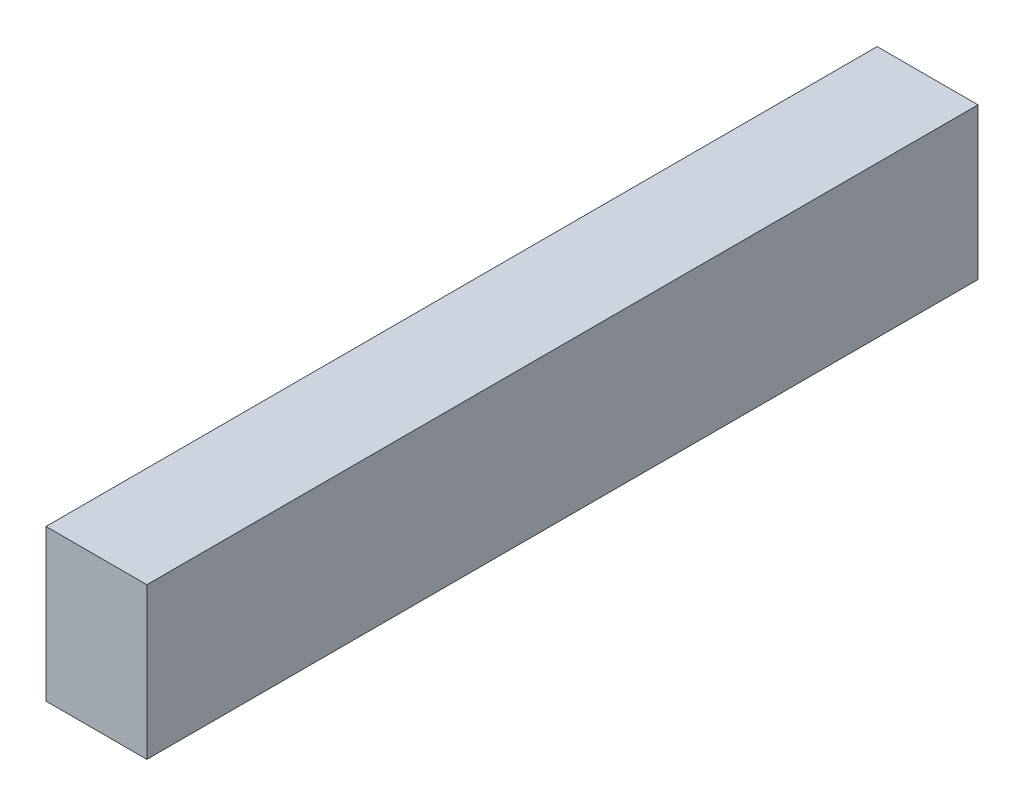
ISO-10303-21;
HEADER;
FILE_DESCRIPTION(('STEP AP214'),'2;1');
FILE_NAME('part.step','',(''),(''),'','','');
FILE_SCHEMA(('AUTOMOTIVE_DESIGN { 1 0 10303 214 1 1 1 1 }'));
ENDSEC;
DATA;
#1=APPLICATION_CONTEXT('core data for automotive mechanical design processes');
#2=APPLICATION_PROTOCOL_DEFINITION('international standard','automotive_design',2000,#1);
#3=PRODUCT_CONTEXT('',#1,'mechanical');
#4=PRODUCT('Part','Part','',(#3));
#5=PRODUCT_RELATED_PRODUCT_CATEGORY('part','',(#4));
#6=PRODUCT_DEFINITION_FORMATION('','',#4);
#7=PRODUCT_DEFINITION_CONTEXT('part definition',#1,'design');
#8=PRODUCT_DEFINITION('design','',#6,#7);
#9=PRODUCT_DEFINITION_SHAPE('','',#8);
#10=(LENGTH_UNIT() NAMED_UNIT(*) SI_UNIT(.MILLI.,.METRE.));
#11=(NAMED_UNIT(*) PLANE_ANGLE_UNIT() SI_UNIT($,.RADIAN.));
#12=(NAMED_UNIT(*) SI_UNIT($,.STERADIAN.) SOLID_ANGLE_UNIT());
#13=UNCERTAINTY_MEASURE_WITH_UNIT(LENGTH_MEASURE(1.E-05),#10,'distance_accuracy_value','');
#14=(GEOMETRIC_REPRESENTATION_CONTEXT(3) GLOBAL_UNCERTAINTY_ASSIGNED_CONTEXT((#13)) GLOBAL_UNIT_ASSIGNED_CONTEXT((#10,
#11,#12)) REPRESENTATION_CONTEXT('',''));
#15=CARTESIAN_POINT('',(0.,0.,0.));
#16=DIRECTION('',(0.,0.,1.));
#17=DIRECTION('',(1.,0.,0.));
#18=AXIS2_PLACEMENT_3D('',#15,#16,#17);
#19=CARTESIAN_POINT('',(1.5875,-2.38125,26.162));
#20=DIRECTION('',(-1.,0.,0.));
#21=DIRECTION('',(0.,0.,1.));
#22=AXIS2_PLACEMENT_3D('',#19,#20,#21);
#23=PLANE('',#22);
#24=DIRECTION('',(0.,1.,0.));
#25=VECTOR('',#24,1.);
#26=CARTESIAN_POINT('',(1.5875,-2.38125,0.));
#27=LINE('',#26,#25);
#28=CARTESIAN_POINT('',(1.5875,-2.38125,0.));
#29=VERTEX_POINT('',#28);
#30=CARTESIAN_POINT('',(1.5875,2.38125,0.));
#31=VERTEX_POINT('',#30);
#32=EDGE_CURVE('E109',#29,#31,#27,.T.);
#33=ORIENTED_EDGE('',*,*,#32,.T.);
#34=DIRECTION('',(0.,0.,-1.));
#35=VECTOR('',#34,1.);
#36=CARTESIAN_POINT('',(1.5875,2.38125,26.162));
#37=LINE('',#36,#35);
#38=CARTESIAN_POINT('',(1.5875,2.38125,26.162));
#39=VERTEX_POINT('',#38);
#40=EDGE_CURVE('E11',#39,#31,#37,.T.);
#41=ORIENTED_EDGE('',*,*,#40,.F.);
#42=DIRECTION('',(0.,1.,0.));
#43=VECTOR('',#42,1.);
#44=CARTESIAN_POINT('',(1.5875,-2.38125,26.162));
#45=LINE('',#44,#43);
#46=CARTESIAN_POINT('',(1.5875,-2.38125,26.162));
#47=VERTEX_POINT('',#46);
#48=EDGE_CURVE('E92',#47,#39,#45,.T.);
#49=ORIENTED_EDGE('',*,*,#48,.F.);
#50=DIRECTION('',(0.,0.,-1.));
#51=VECTOR('',#50,1.);
#52=CARTESIAN_POINT('',(1.5875,-2.38125,26.162));
#53=LINE('',#52,#51);
#54=EDGE_CURVE('E105',#47,#29,#53,.T.);
#55=ORIENTED_EDGE('',*,*,#54,.T.);
#56=EDGE_LOOP('',(#33,#41,#49,#55));
#57=FACE_BOUND('',#56,.T.);
#58=ADVANCED_FACE('F40',(#57),#23,.F.);
#59=CARTESIAN_POINT('',(-1.5875,2.38125,26.162));
#60=DIRECTION('',(0.,-1.,0.));
#61=DIRECTION('',(0.,0.,-1.));
#62=AXIS2_PLACEMENT_3D('',#59,#60,#61);
#63=PLANE('',#62);
#64=DIRECTION('',(-1.,0.,0.));
#65=VECTOR('',#64,1.);
#66=CARTESIAN_POINT('',(-1.5875,2.38125,0.));
#67=LINE('',#66,#65);
#68=CARTESIAN_POINT('',(-1.5875,2.38125,0.));
#69=VERTEX_POINT('',#68);
#70=EDGE_CURVE('E97',#31,#69,#67,.T.);
#71=ORIENTED_EDGE('',*,*,#70,.T.);
#72=DIRECTION('',(0.,0.,-1.));
#73=VECTOR('',#72,1.);
#74=CARTESIAN_POINT('',(-1.5875,2.38125,26.162));
#75=LINE('',#74,#73);
#76=CARTESIAN_POINT('',(-1.5875,2.38125,26.162));
#77=VERTEX_POINT('',#76);
#78=EDGE_CURVE('E49',#77,#69,#75,.T.);
#79=ORIENTED_EDGE('',*,*,#78,.F.);
#80=DIRECTION('',(-1.,0.,0.));
#81=VECTOR('',#80,1.);
#82=CARTESIAN_POINT('',(-1.5875,2.38125,26.162));
#83=LINE('',#82,#81);
#84=EDGE_CURVE('E87',#39,#77,#83,.T.);
#85=ORIENTED_EDGE('',*,*,#84,.F.);
#86=ORIENTED_EDGE('',*,*,#40,.T.);
#87=EDGE_LOOP('',(#71,#79,#85,#86));
#88=FACE_BOUND('',#87,.T.);
#89=ADVANCED_FACE('F96',(#88),#63,.F.);
#90=CARTESIAN_POINT('',(-1.5875,-2.38125,26.162));
#91=DIRECTION('',(1.,0.,0.));
#92=DIRECTION('',(0.,0.,-1.));
#93=AXIS2_PLACEMENT_3D('',#90,#91,#92);
#94=PLANE('',#93);
#95=DIRECTION('',(0.,-1.,0.));
#96=VECTOR('',#95,1.);
#97=CARTESIAN_POINT('',(-1.5875,-2.38125,0.));
#98=LINE('',#97,#96);
#99=CARTESIAN_POINT('',(-1.5875,-2.38125,0.));
#100=VERTEX_POINT('',#99);
#101=EDGE_CURVE('E74',#69,#100,#98,.T.);
#102=ORIENTED_EDGE('',*,*,#101,.T.);
#103=DIRECTION('',(0.,0.,-1.));
#104=VECTOR('',#103,1.);
#105=CARTESIAN_POINT('',(-1.5875,-2.38125,26.162));
#106=LINE('',#105,#104);
#107=CARTESIAN_POINT('',(-1.5875,-2.38125,26.162));
#108=VERTEX_POINT('',#107);
#109=EDGE_CURVE('E99',#108,#100,#106,.T.);
#110=ORIENTED_EDGE('',*,*,#109,.F.);
#111=DIRECTION('',(0.,-1.,0.));
#112=VECTOR('',#111,1.);
#113=CARTESIAN_POINT('',(-1.5875,-2.38125,26.162));
#114=LINE('',#113,#112);
#115=EDGE_CURVE('E90',#77,#108,#114,.T.);
#116=ORIENTED_EDGE('',*,*,#115,.F.);
#117=ORIENTED_EDGE('',*,*,#78,.T.);
#118=EDGE_LOOP('',(#102,#110,#116,#117));
#119=FACE_BOUND('',#118,.T.);
#120=ADVANCED_FACE('F100',(#119),#94,.F.);
#121=CARTESIAN_POINT('',(-1.5875,-2.38125,26.162));
#122=DIRECTION('',(0.,1.,0.));
#123=DIRECTION('',(0.,0.,1.));
#124=AXIS2_PLACEMENT_3D('',#121,#122,#123);
#125=PLANE('',#124);
#126=DIRECTION('',(1.,0.,0.));
#127=VECTOR('',#126,1.);
#128=CARTESIAN_POINT('',(-1.5875,-2.38125,0.));
#129=LINE('',#128,#127);
#130=EDGE_CURVE('E80',#100,#29,#129,.T.);
#131=ORIENTED_EDGE('',*,*,#130,.T.);
#132=ORIENTED_EDGE('',*,*,#54,.F.);
#133=DIRECTION('',(1.,0.,0.));
#134=VECTOR('',#133,1.);
#135=CARTESIAN_POINT('',(-1.5875,-2.38125,26.162));
#136=LINE('',#135,#134);
#137=EDGE_CURVE('E57',#108,#47,#136,.T.);
#138=ORIENTED_EDGE('',*,*,#137,.F.);
#139=ORIENTED_EDGE('',*,*,#109,.T.);
#140=EDGE_LOOP('',(#131,#132,#138,#139));
#141=FACE_BOUND('',#140,.T.);
#142=ADVANCED_FACE('F123',(#141),#125,.F.);
#143=CARTESIAN_POINT('',(0.,0.,26.162));
#144=DIRECTION('',(0.,0.,-1.));
#145=DIRECTION('',(-1.,0.,0.));
#146=AXIS2_PLACEMENT_3D('',#143,#144,#145);
#147=PLANE('',#146);
#148=ORIENTED_EDGE('',*,*,#48,.T.);
#149=ORIENTED_EDGE('',*,*,#84,.T.);
#150=ORIENTED_EDGE('',*,*,#115,.T.);
#151=ORIENTED_EDGE('',*,*,#137,.T.);
#152=EDGE_LOOP('',(#148,#149,#150,#151));
#153=FACE_BOUND('',#152,.T.);
#154=ADVANCED_FACE('F88',(#153),#147,.F.);
#155=CARTESIAN_POINT('',(0.,0.,0.));
#156=DIRECTION('',(0.,0.,-1.));
#157=DIRECTION('',(-1.,0.,0.));
#158=AXIS2_PLACEMENT_3D('',#155,#156,#157);
#159=PLANE('',#158);
#160=ORIENTED_EDGE('',*,*,#32,.F.);
#161=ORIENTED_EDGE('',*,*,#130,.F.);
#162=ORIENTED_EDGE('',*,*,#101,.F.);
#163=ORIENTED_EDGE('',*,*,#70,.F.);
#164=EDGE_LOOP('',(#160,#161,#162,#163));
#165=FACE_BOUND('',#164,.T.);
#166=ADVANCED_FACE('F126',(#165),#159,.T.);
#167=CLOSED_SHELL('',(#58,#89,#120,#142,#154,#166));
#168=MANIFOLD_SOLID_BREP('B2',#167);
#169=ADVANCED_BREP_SHAPE_REPRESENTATION('',(#18,#168),#14);
#170=SHAPE_DEFINITION_REPRESENTATION(#9,#169);
ENDSEC;
END-ISO-10303-21;
